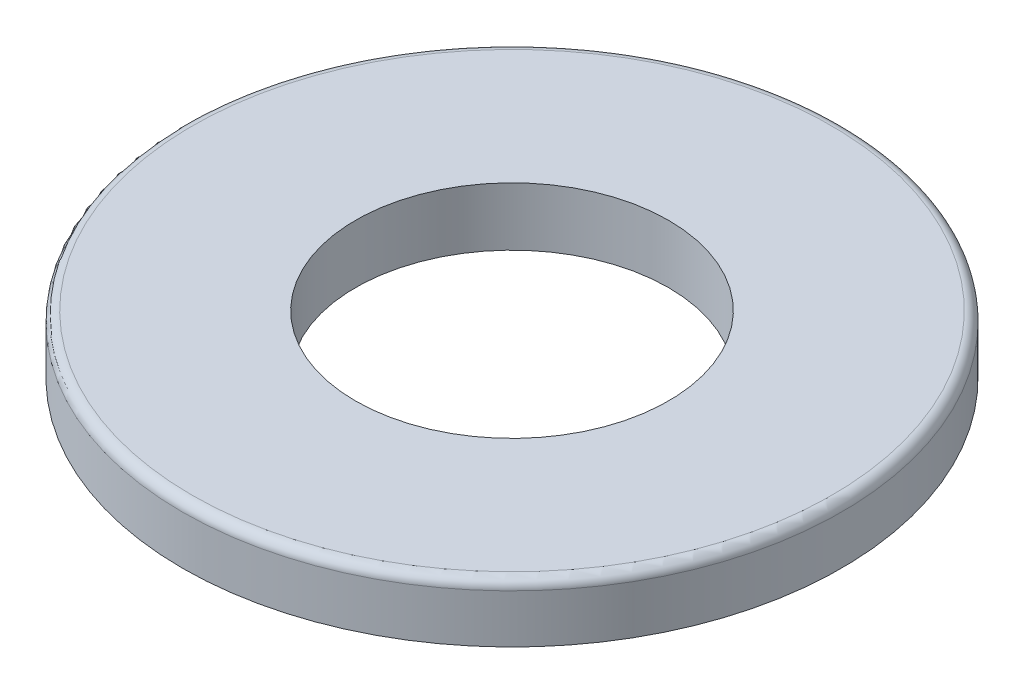
ISO-10303-21;
HEADER;
FILE_DESCRIPTION(('STEP AP214'),'2;1');
FILE_NAME('part.step','',(''),(''),'','','');
FILE_SCHEMA(('AUTOMOTIVE_DESIGN { 1 0 10303 214 1 1 1 1 }'));
ENDSEC;
DATA;
#1=APPLICATION_CONTEXT('core data for automotive mechanical design processes');
#2=APPLICATION_PROTOCOL_DEFINITION('international standard','automotive_design',2000,#1);
#3=PRODUCT_CONTEXT('',#1,'mechanical');
#4=PRODUCT('Part','Part','',(#3));
#5=PRODUCT_RELATED_PRODUCT_CATEGORY('part','',(#4));
#6=PRODUCT_DEFINITION_FORMATION('','',#4);
#7=PRODUCT_DEFINITION_CONTEXT('part definition',#1,'design');
#8=PRODUCT_DEFINITION('design','',#6,#7);
#9=PRODUCT_DEFINITION_SHAPE('','',#8);
#10=(LENGTH_UNIT() NAMED_UNIT(*) SI_UNIT(.MILLI.,.METRE.));
#11=(NAMED_UNIT(*) PLANE_ANGLE_UNIT() SI_UNIT($,.RADIAN.));
#12=(NAMED_UNIT(*) SI_UNIT($,.STERADIAN.) SOLID_ANGLE_UNIT());
#13=UNCERTAINTY_MEASURE_WITH_UNIT(LENGTH_MEASURE(1.E-05),#10,'distance_accuracy_value','');
#14=(GEOMETRIC_REPRESENTATION_CONTEXT(3) GLOBAL_UNCERTAINTY_ASSIGNED_CONTEXT((#13)) GLOBAL_UNIT_ASSIGNED_CONTEXT((#10,
#11,#12)) REPRESENTATION_CONTEXT('',''));
#15=CARTESIAN_POINT('',(0.,0.,0.));
#16=DIRECTION('',(0.,0.,1.));
#17=DIRECTION('',(1.,0.,0.));
#18=AXIS2_PLACEMENT_3D('',#15,#16,#17);
#19=CARTESIAN_POINT('',(0.,3.,0.));
#20=DIRECTION('',(0.,1.,0.));
#21=DIRECTION('',(0.,0.,1.));
#22=AXIS2_PLACEMENT_3D('',#19,#20,#21);
#23=PLANE('',#22);
#24=CARTESIAN_POINT('',(0.,3.,0.));
#25=DIRECTION('',(0.,1.,0.));
#26=DIRECTION('',(0.,0.,1.));
#27=AXIS2_PLACEMENT_3D('',#24,#25,#26);
#28=CIRCLE('',#27,16.45);
#29=CARTESIAN_POINT('',(0.,3.,16.45));
#30=VERTEX_POINT('',#29);
#31=EDGE_CURVE('E42',#30,#30,#28,.T.);
#32=ORIENTED_EDGE('',*,*,#31,.T.);
#33=EDGE_LOOP('',(#32));
#34=FACE_BOUND('',#33,.T.);
#35=CARTESIAN_POINT('',(0.,3.,0.));
#36=DIRECTION('',(0.,1.,0.));
#37=DIRECTION('',(0.,0.,1.));
#38=AXIS2_PLACEMENT_3D('',#35,#36,#37);
#39=CIRCLE('',#38,8.05);
#40=CARTESIAN_POINT('',(0.,3.,8.05));
#41=VERTEX_POINT('',#40);
#42=EDGE_CURVE('E50',#41,#41,#39,.T.);
#43=ORIENTED_EDGE('',*,*,#42,.F.);
#44=EDGE_LOOP('',(#43));
#45=FACE_BOUND('',#44,.T.);
#46=ADVANCED_FACE('F35',(#34,#45),#23,.T.);
#47=CARTESIAN_POINT('',(0.,0.,0.));
#48=DIRECTION('',(0.,1.,0.));
#49=DIRECTION('',(0.,0.,1.));
#50=AXIS2_PLACEMENT_3D('',#47,#48,#49);
#51=PLANE('',#50);
#52=CARTESIAN_POINT('',(0.,0.,0.));
#53=DIRECTION('',(0.,1.,0.));
#54=DIRECTION('',(0.,0.,1.));
#55=AXIS2_PLACEMENT_3D('',#52,#53,#54);
#56=CIRCLE('',#55,16.95);
#57=CARTESIAN_POINT('',(0.,0.,16.95));
#58=VERTEX_POINT('',#57);
#59=EDGE_CURVE('E46',#58,#58,#56,.T.);
#60=ORIENTED_EDGE('',*,*,#59,.F.);
#61=EDGE_LOOP('',(#60));
#62=FACE_BOUND('',#61,.T.);
#63=CARTESIAN_POINT('',(0.,0.,0.));
#64=DIRECTION('',(0.,1.,0.));
#65=DIRECTION('',(0.,0.,1.));
#66=AXIS2_PLACEMENT_3D('',#63,#64,#65);
#67=CIRCLE('',#66,8.05);
#68=CARTESIAN_POINT('',(0.,0.,8.05));
#69=VERTEX_POINT('',#68);
#70=EDGE_CURVE('E53',#69,#69,#67,.T.);
#71=ORIENTED_EDGE('',*,*,#70,.T.);
#72=EDGE_LOOP('',(#71));
#73=FACE_BOUND('',#72,.T.);
#74=ADVANCED_FACE('F63',(#62,#73),#51,.F.);
#75=CARTESIAN_POINT('',(0.,3.,0.));
#76=DIRECTION('',(0.,-1.,0.));
#77=DIRECTION('',(0.,0.,-1.));
#78=AXIS2_PLACEMENT_3D('',#75,#76,#77);
#79=CYLINDRICAL_SURFACE('',#78,16.95);
#80=CARTESIAN_POINT('',(0.,2.5,0.));
#81=DIRECTION('',(0.,1.,0.));
#82=DIRECTION('',(0.,0.,1.));
#83=AXIS2_PLACEMENT_3D('',#80,#81,#82);
#84=CIRCLE('',#83,16.95);
#85=CARTESIAN_POINT('',(0.,2.5,16.95));
#86=VERTEX_POINT('',#85);
#87=EDGE_CURVE('E10',#86,#86,#84,.F.);
#88=ORIENTED_EDGE('',*,*,#87,.T.);
#89=EDGE_LOOP('',(#88));
#90=FACE_BOUND('',#89,.T.);
#91=ORIENTED_EDGE('',*,*,#59,.T.);
#92=EDGE_LOOP('',(#91));
#93=FACE_BOUND('',#92,.T.);
#94=ADVANCED_FACE('F68',(#90,#93),#79,.T.);
#95=CARTESIAN_POINT('',(0.,3.,0.));
#96=DIRECTION('',(0.,-1.,0.));
#97=DIRECTION('',(0.,0.,-1.));
#98=AXIS2_PLACEMENT_3D('',#95,#96,#97);
#99=CYLINDRICAL_SURFACE('',#98,8.05);
#100=ORIENTED_EDGE('',*,*,#42,.T.);
#101=EDGE_LOOP('',(#100));
#102=FACE_BOUND('',#101,.T.);
#103=ORIENTED_EDGE('',*,*,#70,.F.);
#104=EDGE_LOOP('',(#103));
#105=FACE_BOUND('',#104,.T.);
#106=ADVANCED_FACE('F59',(#102,#105),#99,.F.);
#107=CARTESIAN_POINT('',(0.,2.5,0.));
#108=DIRECTION('',(0.,1.,0.));
#109=DIRECTION('',(0.,0.,1.));
#110=AXIS2_PLACEMENT_3D('',#107,#108,#109);
#111=TOROIDAL_SURFACE('',#110,16.45,0.5);
#112=ORIENTED_EDGE('',*,*,#87,.F.);
#113=EDGE_LOOP('',(#112));
#114=FACE_BOUND('',#113,.T.);
#115=ORIENTED_EDGE('',*,*,#31,.F.);
#116=EDGE_LOOP('',(#115));
#117=FACE_BOUND('',#116,.T.);
#118=ADVANCED_FACE('F37',(#114,#117),#111,.T.);
#119=CLOSED_SHELL('',(#46,#74,#94,#106,#118));
#120=MANIFOLD_SOLID_BREP('B2',#119);
#121=ADVANCED_BREP_SHAPE_REPRESENTATION('',(#18,#120),#14);
#122=SHAPE_DEFINITION_REPRESENTATION(#9,#121);
ENDSEC;
END-ISO-10303-21;
